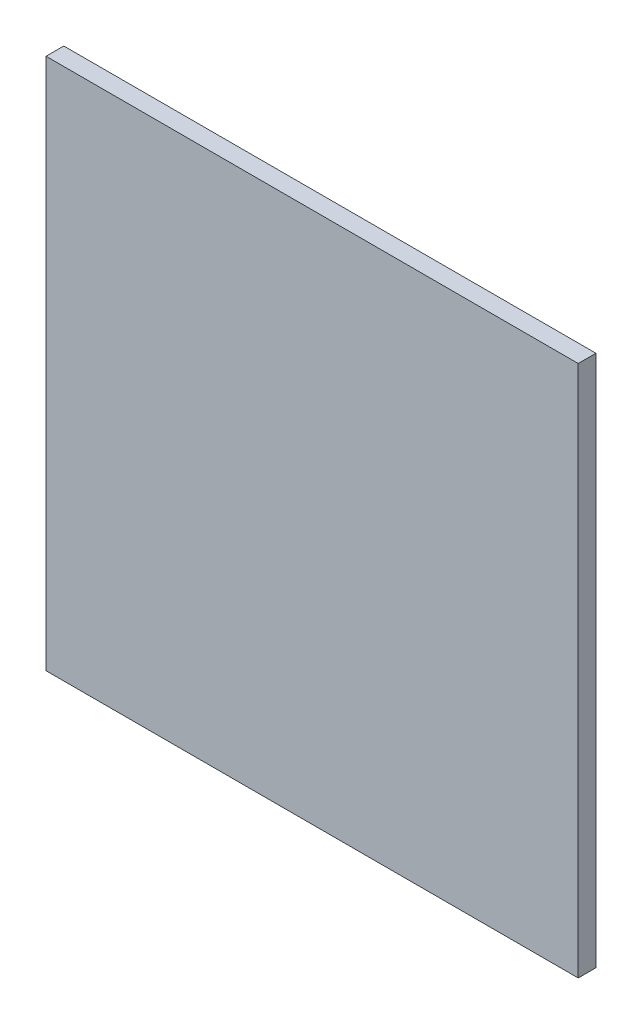
ISO-10303-21;
HEADER;
FILE_DESCRIPTION(('STEP AP214'),'2;1');
FILE_NAME('part.step','',(''),(''),'','','');
FILE_SCHEMA(('AUTOMOTIVE_DESIGN { 1 0 10303 214 1 1 1 1 }'));
ENDSEC;
DATA;
#1=APPLICATION_CONTEXT('core data for automotive mechanical design processes');
#2=APPLICATION_PROTOCOL_DEFINITION('international standard','automotive_design',2000,#1);
#3=PRODUCT_CONTEXT('',#1,'mechanical');
#4=PRODUCT('Part','Part','',(#3));
#5=PRODUCT_RELATED_PRODUCT_CATEGORY('part','',(#4));
#6=PRODUCT_DEFINITION_FORMATION('','',#4);
#7=PRODUCT_DEFINITION_CONTEXT('part definition',#1,'design');
#8=PRODUCT_DEFINITION('design','',#6,#7);
#9=PRODUCT_DEFINITION_SHAPE('','',#8);
#10=(LENGTH_UNIT() NAMED_UNIT(*) SI_UNIT(.MILLI.,.METRE.));
#11=(NAMED_UNIT(*) PLANE_ANGLE_UNIT() SI_UNIT($,.RADIAN.));
#12=(NAMED_UNIT(*) SI_UNIT($,.STERADIAN.) SOLID_ANGLE_UNIT());
#13=UNCERTAINTY_MEASURE_WITH_UNIT(LENGTH_MEASURE(1.E-05),#10,'distance_accuracy_value','');
#14=(GEOMETRIC_REPRESENTATION_CONTEXT(3) GLOBAL_UNCERTAINTY_ASSIGNED_CONTEXT((#13)) GLOBAL_UNIT_ASSIGNED_CONTEXT((#10,
#11,#12)) REPRESENTATION_CONTEXT('',''));
#15=CARTESIAN_POINT('',(0.,0.,0.));
#16=DIRECTION('',(0.,0.,1.));
#17=DIRECTION('',(1.,0.,0.));
#18=AXIS2_PLACEMENT_3D('',#15,#16,#17);
#19=CARTESIAN_POINT('',(-81.3088447053612,12.9222972972973,10.));
#20=DIRECTION('',(1.,0.,0.));
#21=DIRECTION('',(0.,1.,0.));
#22=AXIS2_PLACEMENT_3D('',#19,#20,#21);
#23=PLANE('',#22);
#24=DIRECTION('',(0.,-1.,0.));
#25=VECTOR('',#24,1.);
#26=CARTESIAN_POINT('',(-81.3088447053612,12.9222972972973,0.));
#27=LINE('',#26,#25);
#28=CARTESIAN_POINT('',(-81.3088447053612,12.9222972972973,0.));
#29=VERTEX_POINT('',#28);
#30=CARTESIAN_POINT('',(-81.3088447053611,-287.077702702703,0.));
#31=VERTEX_POINT('',#30);
#32=EDGE_CURVE('E97',#29,#31,#27,.T.);
#33=ORIENTED_EDGE('',*,*,#32,.T.);
#34=DIRECTION('',(0.,0.,-1.));
#35=VECTOR('',#34,1.);
#36=CARTESIAN_POINT('',(-81.3088447053611,-287.077702702703,10.));
#37=LINE('',#36,#35);
#38=CARTESIAN_POINT('',(-81.3088447053611,-287.077702702703,10.));
#39=VERTEX_POINT('',#38);
#40=EDGE_CURVE('E11',#39,#31,#37,.T.);
#41=ORIENTED_EDGE('',*,*,#40,.F.);
#42=DIRECTION('',(0.,-1.,0.));
#43=VECTOR('',#42,1.);
#44=CARTESIAN_POINT('',(-81.3088447053612,12.9222972972973,10.));
#45=LINE('',#44,#43);
#46=CARTESIAN_POINT('',(-81.3088447053612,12.9222972972973,10.));
#47=VERTEX_POINT('',#46);
#48=EDGE_CURVE('E85',#47,#39,#45,.T.);
#49=ORIENTED_EDGE('',*,*,#48,.F.);
#50=DIRECTION('',(0.,0.,-1.));
#51=VECTOR('',#50,1.);
#52=CARTESIAN_POINT('',(-81.3088447053612,12.9222972972973,10.));
#53=LINE('',#52,#51);
#54=EDGE_CURVE('E93',#47,#29,#53,.T.);
#55=ORIENTED_EDGE('',*,*,#54,.T.);
#56=EDGE_LOOP('',(#33,#41,#49,#55));
#57=FACE_BOUND('',#56,.T.);
#58=ADVANCED_FACE('F34',(#57),#23,.F.);
#59=CARTESIAN_POINT('',(-81.3088447053611,-287.077702702703,10.));
#60=DIRECTION('',(0.,1.,0.));
#61=DIRECTION('',(0.,0.,1.));
#62=AXIS2_PLACEMENT_3D('',#59,#60,#61);
#63=PLANE('',#62);
#64=DIRECTION('',(1.,0.,0.));
#65=VECTOR('',#64,1.);
#66=CARTESIAN_POINT('',(-81.3088447053611,-287.077702702703,0.));
#67=LINE('',#66,#65);
#68=CARTESIAN_POINT('',(218.691155294639,-287.077702702703,0.));
#69=VERTEX_POINT('',#68);
#70=EDGE_CURVE('E89',#31,#69,#67,.T.);
#71=ORIENTED_EDGE('',*,*,#70,.T.);
#72=DIRECTION('',(0.,0.,-1.));
#73=VECTOR('',#72,1.);
#74=CARTESIAN_POINT('',(218.691155294639,-287.077702702703,10.));
#75=LINE('',#74,#73);
#76=CARTESIAN_POINT('',(218.691155294639,-287.077702702703,10.));
#77=VERTEX_POINT('',#76);
#78=EDGE_CURVE('E42',#77,#69,#75,.T.);
#79=ORIENTED_EDGE('',*,*,#78,.F.);
#80=DIRECTION('',(1.,0.,0.));
#81=VECTOR('',#80,1.);
#82=CARTESIAN_POINT('',(-81.3088447053611,-287.077702702703,10.));
#83=LINE('',#82,#81);
#84=EDGE_CURVE('E80',#39,#77,#83,.T.);
#85=ORIENTED_EDGE('',*,*,#84,.F.);
#86=ORIENTED_EDGE('',*,*,#40,.T.);
#87=EDGE_LOOP('',(#71,#79,#85,#86));
#88=FACE_BOUND('',#87,.T.);
#89=ADVANCED_FACE('F88',(#88),#63,.F.);
#90=CARTESIAN_POINT('',(218.691155294639,12.9222972972973,10.));
#91=DIRECTION('',(-1.,0.,0.));
#92=DIRECTION('',(0.,-1.,0.));
#93=AXIS2_PLACEMENT_3D('',#90,#91,#92);
#94=PLANE('',#93);
#95=DIRECTION('',(0.,1.,0.));
#96=VECTOR('',#95,1.);
#97=CARTESIAN_POINT('',(218.691155294639,12.9222972972973,0.));
#98=LINE('',#97,#96);
#99=CARTESIAN_POINT('',(218.691155294639,12.9222972972973,0.));
#100=VERTEX_POINT('',#99);
#101=EDGE_CURVE('E67',#69,#100,#98,.T.);
#102=ORIENTED_EDGE('',*,*,#101,.T.);
#103=DIRECTION('',(0.,0.,-1.));
#104=VECTOR('',#103,1.);
#105=CARTESIAN_POINT('',(218.691155294639,12.9222972972973,10.));
#106=LINE('',#105,#104);
#107=CARTESIAN_POINT('',(218.691155294639,12.9222972972973,10.));
#108=VERTEX_POINT('',#107);
#109=EDGE_CURVE('E90',#108,#100,#106,.T.);
#110=ORIENTED_EDGE('',*,*,#109,.F.);
#111=DIRECTION('',(0.,1.,0.));
#112=VECTOR('',#111,1.);
#113=CARTESIAN_POINT('',(218.691155294639,12.9222972972973,10.));
#114=LINE('',#113,#112);
#115=EDGE_CURVE('E83',#77,#108,#114,.T.);
#116=ORIENTED_EDGE('',*,*,#115,.F.);
#117=ORIENTED_EDGE('',*,*,#78,.T.);
#118=EDGE_LOOP('',(#102,#110,#116,#117));
#119=FACE_BOUND('',#118,.T.);
#120=ADVANCED_FACE('F91',(#119),#94,.F.);
#121=CARTESIAN_POINT('',(-81.3088447053612,12.9222972972973,10.));
#122=DIRECTION('',(0.,-1.,0.));
#123=DIRECTION('',(0.,0.,-1.));
#124=AXIS2_PLACEMENT_3D('',#121,#122,#123);
#125=PLANE('',#124);
#126=DIRECTION('',(-1.,0.,0.));
#127=VECTOR('',#126,1.);
#128=CARTESIAN_POINT('',(-81.3088447053612,12.9222972972973,0.));
#129=LINE('',#128,#127);
#130=EDGE_CURVE('E73',#100,#29,#129,.T.);
#131=ORIENTED_EDGE('',*,*,#130,.T.);
#132=ORIENTED_EDGE('',*,*,#54,.F.);
#133=DIRECTION('',(-1.,0.,0.));
#134=VECTOR('',#133,1.);
#135=CARTESIAN_POINT('',(-81.3088447053612,12.9222972972973,10.));
#136=LINE('',#135,#134);
#137=EDGE_CURVE('E50',#108,#47,#136,.T.);
#138=ORIENTED_EDGE('',*,*,#137,.F.);
#139=ORIENTED_EDGE('',*,*,#109,.T.);
#140=EDGE_LOOP('',(#131,#132,#138,#139));
#141=FACE_BOUND('',#140,.T.);
#142=ADVANCED_FACE('F104',(#141),#125,.F.);
#143=CARTESIAN_POINT('',(0.,0.,10.));
#144=DIRECTION('',(0.,0.,1.));
#145=DIRECTION('',(1.,0.,0.));
#146=AXIS2_PLACEMENT_3D('',#143,#144,#145);
#147=PLANE('',#146);
#148=ORIENTED_EDGE('',*,*,#48,.T.);
#149=ORIENTED_EDGE('',*,*,#84,.T.);
#150=ORIENTED_EDGE('',*,*,#115,.T.);
#151=ORIENTED_EDGE('',*,*,#137,.T.);
#152=EDGE_LOOP('',(#148,#149,#150,#151));
#153=FACE_BOUND('',#152,.T.);
#154=ADVANCED_FACE('F81',(#153),#147,.T.);
#155=CARTESIAN_POINT('',(0.,0.,0.));
#156=DIRECTION('',(0.,0.,1.));
#157=DIRECTION('',(1.,0.,0.));
#158=AXIS2_PLACEMENT_3D('',#155,#156,#157);
#159=PLANE('',#158);
#160=ORIENTED_EDGE('',*,*,#32,.F.);
#161=ORIENTED_EDGE('',*,*,#130,.F.);
#162=ORIENTED_EDGE('',*,*,#101,.F.);
#163=ORIENTED_EDGE('',*,*,#70,.F.);
#164=EDGE_LOOP('',(#160,#161,#162,#163));
#165=FACE_BOUND('',#164,.T.);
#166=ADVANCED_FACE('F107',(#165),#159,.F.);
#167=CLOSED_SHELL('',(#58,#89,#120,#142,#154,#166));
#168=MANIFOLD_SOLID_BREP('B2',#167);
#169=ADVANCED_BREP_SHAPE_REPRESENTATION('',(#18,#168),#14);
#170=SHAPE_DEFINITION_REPRESENTATION(#9,#169);
ENDSEC;
END-ISO-10303-21;
